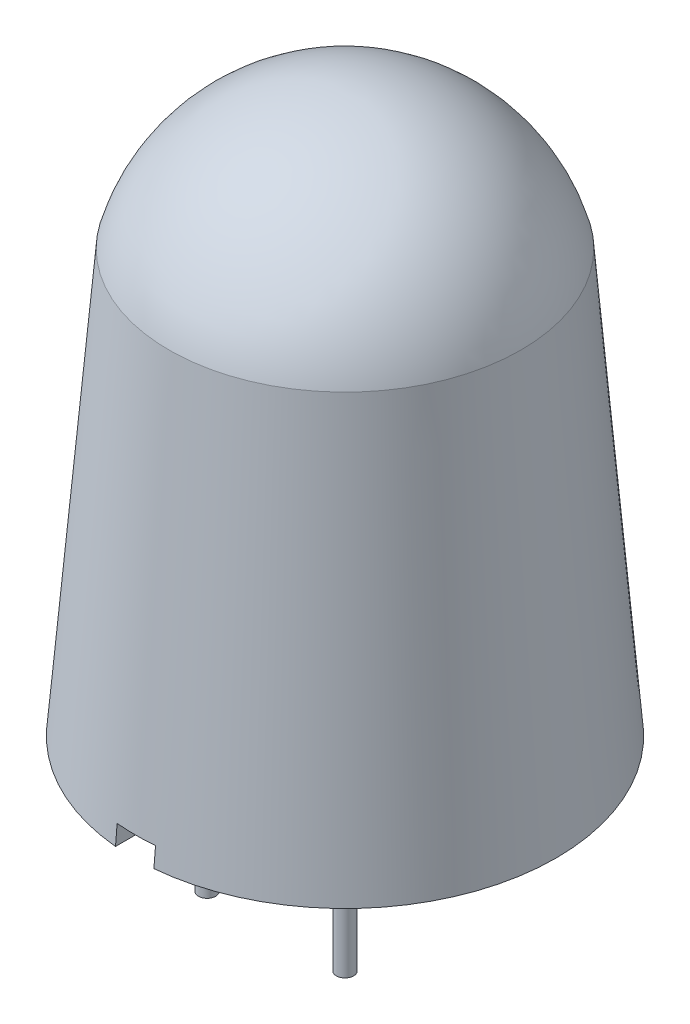
ISO-10303-21;
HEADER;
FILE_DESCRIPTION(('STEP AP214'),'2;1');
FILE_NAME('part.step','',(''),(''),'','','');
FILE_SCHEMA(('AUTOMOTIVE_DESIGN { 1 0 10303 214 1 1 1 1 }'));
ENDSEC;
DATA;
#1=APPLICATION_CONTEXT('core data for automotive mechanical design processes');
#2=APPLICATION_PROTOCOL_DEFINITION('international standard','automotive_design',2000,#1);
#3=PRODUCT_CONTEXT('',#1,'mechanical');
#4=PRODUCT('Part','Part','',(#3));
#5=PRODUCT_RELATED_PRODUCT_CATEGORY('part','',(#4));
#6=PRODUCT_DEFINITION_FORMATION('','',#4);
#7=PRODUCT_DEFINITION_CONTEXT('part definition',#1,'design');
#8=PRODUCT_DEFINITION('design','',#6,#7);
#9=PRODUCT_DEFINITION_SHAPE('','',#8);
#10=(LENGTH_UNIT() NAMED_UNIT(*) SI_UNIT(.MILLI.,.METRE.));
#11=(NAMED_UNIT(*) PLANE_ANGLE_UNIT() SI_UNIT($,.RADIAN.));
#12=(NAMED_UNIT(*) SI_UNIT($,.STERADIAN.) SOLID_ANGLE_UNIT());
#13=UNCERTAINTY_MEASURE_WITH_UNIT(LENGTH_MEASURE(1.E-05),#10,'distance_accuracy_value','');
#14=(GEOMETRIC_REPRESENTATION_CONTEXT(3) GLOBAL_UNCERTAINTY_ASSIGNED_CONTEXT((#13)) GLOBAL_UNIT_ASSIGNED_CONTEXT((#10,
#11,#12)) REPRESENTATION_CONTEXT('',''));
#15=CARTESIAN_POINT('',(0.,0.,0.));
#16=DIRECTION('',(0.,0.,1.));
#17=DIRECTION('',(1.,0.,0.));
#18=AXIS2_PLACEMENT_3D('',#15,#16,#17);
#19=CARTESIAN_POINT('',(0.,1.,0.));
#20=DIRECTION('',(0.,-1.,0.));
#21=DIRECTION('',(0.,0.,-1.));
#22=AXIS2_PLACEMENT_3D('',#19,#20,#21);
#23=PLANE('',#22);
#24=CARTESIAN_POINT('',(-1.79605122421383,1.,1.79605122421383));
#25=DIRECTION('',(0.,-1.,0.));
#26=DIRECTION('',(0.,0.,-1.));
#27=AXIS2_PLACEMENT_3D('',#24,#25,#26);
#28=CIRCLE('',#27,0.225);
#29=CARTESIAN_POINT('',(-1.79605122421383,1.,1.57105122421383));
#30=VERTEX_POINT('',#29);
#31=EDGE_CURVE('E218',#30,#30,#28,.T.);
#32=ORIENTED_EDGE('',*,*,#31,.F.);
#33=EDGE_LOOP('',(#32));
#34=FACE_BOUND('',#33,.T.);
#35=CARTESIAN_POINT('',(0.,1.,0.));
#36=DIRECTION('',(0.,-1.,0.));
#37=DIRECTION('',(0.,0.,-1.));
#38=AXIS2_PLACEMENT_3D('',#35,#36,#37);
#39=CIRCLE('',#38,5.);
#40=CARTESIAN_POINT('',(0.,1.,-5.));
#41=VERTEX_POINT('',#40);
#42=EDGE_CURVE('E169',#41,#41,#39,.T.);
#43=ORIENTED_EDGE('',*,*,#42,.T.);
#44=EDGE_LOOP('',(#43));
#45=FACE_BOUND('',#44,.T.);
#46=CARTESIAN_POINT('',(1.79605122421384,1.,1.79605122421382));
#47=DIRECTION('',(0.,-1.,0.));
#48=DIRECTION('',(0.,0.,-1.));
#49=AXIS2_PLACEMENT_3D('',#46,#47,#48);
#50=CIRCLE('',#49,0.225);
#51=CARTESIAN_POINT('',(1.79605122421384,1.,1.57105122421382));
#52=VERTEX_POINT('',#51);
#53=EDGE_CURVE('E212',#52,#52,#50,.T.);
#54=ORIENTED_EDGE('',*,*,#53,.F.);
#55=EDGE_LOOP('',(#54));
#56=FACE_BOUND('',#55,.T.);
#57=CARTESIAN_POINT('',(-1.79605122421383,1.,-1.79605122421383));
#58=DIRECTION('',(0.,-1.,0.));
#59=DIRECTION('',(0.,0.,-1.));
#60=AXIS2_PLACEMENT_3D('',#57,#58,#59);
#61=CIRCLE('',#60,0.225);
#62=CARTESIAN_POINT('',(-1.79605122421383,1.,-2.02105122421383));
#63=VERTEX_POINT('',#62);
#64=EDGE_CURVE('E224',#63,#63,#61,.T.);
#65=ORIENTED_EDGE('',*,*,#64,.F.);
#66=EDGE_LOOP('',(#65));
#67=FACE_BOUND('',#66,.T.);
#68=ADVANCED_FACE('F37',(#34,#45,#56,#67),#23,.T.);
#69=CARTESIAN_POINT('',(0.,0.,0.));
#70=DIRECTION('',(0.,-1.,0.));
#71=DIRECTION('',(0.,0.,-1.));
#72=AXIS2_PLACEMENT_3D('',#69,#70,#71);
#73=CONICAL_SURFACE('',#72,5.5,0.0832096327061914);
#74=CARTESIAN_POINT('',(0.,11.,0.));
#75=DIRECTION('',(0.,-1.,0.));
#76=DIRECTION('',(0.,0.,-1.));
#77=AXIS2_PLACEMENT_3D('',#74,#75,#76);
#78=CIRCLE('',#77,4.58257569495584);
#79=CARTESIAN_POINT('',(0.,11.,-4.58257569495584));
#80=VERTEX_POINT('',#79);
#81=EDGE_CURVE('E179',#80,#80,#78,.T.);
#82=ORIENTED_EDGE('',*,*,#81,.T.);
#83=EDGE_LOOP('',(#82));
#84=FACE_BOUND('',#83,.T.);
#85=CARTESIAN_POINT('',(0.,0.5,0.));
#86=DIRECTION('',(0.,-1.,0.));
#87=DIRECTION('',(1.,0.,0.));
#88=AXIS2_PLACEMENT_3D('',#85,#86,#87);
#89=CIRCLE('',#88,5.45829889522526);
#90=CARTESIAN_POINT('',(0.5,0.5,-5.43534974308161));
#91=VERTEX_POINT('',#90);
#92=CARTESIAN_POINT('',(-0.5,0.5,-5.43534974308161));
#93=VERTEX_POINT('',#92);
#94=EDGE_CURVE('E124',#91,#93,#89,.F.);
#95=ORIENTED_EDGE('',*,*,#94,.T.);
#96=CARTESIAN_POINT('',(-0.5,10.426058612618,-4.60336926887664));
#97=CARTESIAN_POINT('',(-0.5,7.58595297669956,-4.84162572773607));
#98=CARTESIAN_POINT('',(-0.5,4.74583095498223,-5.07968671489484));
#99=CARTESIAN_POINT('',(-0.5,1.39081472009744,-5.36073740639706));
#100=CARTESIAN_POINT('',(-0.5,0.87593202342233,-5.40386457635922));
#101=CARTESIAN_POINT('',(-0.5,-2.99397219509746,-5.72797927626828));
#102=CARTESIAN_POINT('',(-0.5,-6.34900883615305,-6.00878630840863));
#103=CARTESIAN_POINT('',(-0.5,-9.70405357955887,-6.28949640702513));
#104=B_SPLINE_CURVE_WITH_KNOTS('',3,(#96,#97,#98,#99,#100,#101,#102,#103),.UNSPECIFIED.,.F.,.F.,
(4,2,2,4),(0.,8.55024532182711,10.1003025133284,20.2006050143794),.UNSPECIFIED.);
#105=CARTESIAN_POINT('',(-0.5,0.,-5.47722557505166));
#106=VERTEX_POINT('',#105);
#107=EDGE_CURVE('E158',#93,#106,#104,.T.);
#108=ORIENTED_EDGE('',*,*,#107,.T.);
#109=CARTESIAN_POINT('',(0.,0.,0.));
#110=DIRECTION('',(0.,-1.,0.));
#111=DIRECTION('',(0.,0.,-1.));
#112=AXIS2_PLACEMENT_3D('',#109,#110,#111);
#113=CIRCLE('',#112,5.5);
#114=CARTESIAN_POINT('',(-0.5,0.,5.47722557505166));
#115=VERTEX_POINT('',#114);
#116=EDGE_CURVE('E172',#115,#106,#113,.T.);
#117=ORIENTED_EDGE('',*,*,#116,.F.);
#118=CARTESIAN_POINT('',(-0.5,-9.70405357955887,6.28949640702513));
#119=CARTESIAN_POINT('',(-0.5,-8.0265308802767,6.14914522943913));
#120=CARTESIAN_POINT('',(-0.5,-6.34901052087661,6.00876607758495));
#121=CARTESIAN_POINT('',(-0.5,-2.99397587699082,5.7279352610525));
#122=CARTESIAN_POINT('',(-0.5,-1.31646159250511,5.58748359637446));
#123=CARTESIAN_POINT('',(-0.5,2.03855951881204,5.30649118886826));
#124=CARTESIAN_POINT('',(-0.5,3.71606634564347,5.16595044604));
#125=CARTESIAN_POINT('',(-0.5,7.07107030803121,4.88475327406694));
#126=CARTESIAN_POINT('',(-0.5,8.74856744358748,4.74409684492179));
#127=CARTESIAN_POINT('',(-0.5,10.426058612618,4.60336926887664));
#128=B_SPLINE_CURVE_WITH_KNOTS('',3,(#118,#119,#120,#121,#122,#123,#124,#125,#126,#127),
.UNSPECIFIED.,.F.,.F.,(4,2,2,2,4),(0.,5.05015125941694,10.1003025034101,15.1504537539167,
20.2006050199563),.UNSPECIFIED.);
#129=CARTESIAN_POINT('',(-0.5,0.5,5.43534974308161));
#130=VERTEX_POINT('',#129);
#131=EDGE_CURVE('E123',#115,#130,#128,.T.);
#132=ORIENTED_EDGE('',*,*,#131,.T.);
#133=CARTESIAN_POINT('',(0.5,0.5,5.43534974308161));
#134=VERTEX_POINT('',#133);
#135=EDGE_CURVE('E115',#130,#134,#89,.F.);
#136=ORIENTED_EDGE('',*,*,#135,.T.);
#137=CARTESIAN_POINT('',(0.500000000000002,10.426058612618,4.60336926887664));
#138=CARTESIAN_POINT('',(0.500000000000002,7.58595297669956,4.84162572773607));
#139=CARTESIAN_POINT('',(0.500000000000001,4.74583095498223,5.07968671489484));
#140=CARTESIAN_POINT('',(0.5,1.39081472009744,5.36073740639706));
#141=CARTESIAN_POINT('',(0.5,0.875932023422331,5.40386457635922));
#142=CARTESIAN_POINT('',(0.499999999999999,-2.99397219509746,5.72797927626828));
#143=CARTESIAN_POINT('',(0.499999999999999,-6.34900883615305,6.00878630840863));
#144=CARTESIAN_POINT('',(0.499999999999998,-9.70405357955887,6.28949640702513));
#145=B_SPLINE_CURVE_WITH_KNOTS('',3,(#137,#138,#139,#140,#141,#142,#143,#144),.UNSPECIFIED.,.F.,
.F.,(4,2,2,4),(0.,8.55024532182711,10.1003025133284,20.2006050143794),.UNSPECIFIED.);
#146=CARTESIAN_POINT('',(0.5,0.,5.47722557505166));
#147=VERTEX_POINT('',#146);
#148=EDGE_CURVE('E101',#134,#147,#145,.T.);
#149=ORIENTED_EDGE('',*,*,#148,.T.);
#150=CARTESIAN_POINT('',(0.5,0.,-5.47722557505166));
#151=VERTEX_POINT('',#150);
#152=EDGE_CURVE('E178',#151,#147,#113,.T.);
#153=ORIENTED_EDGE('',*,*,#152,.F.);
#154=CARTESIAN_POINT('',(0.499999999999998,-9.70405357955887,-6.28949640702513));
#155=CARTESIAN_POINT('',(0.499999999999998,-8.0265308802767,-6.14914522943913));
#156=CARTESIAN_POINT('',(0.499999999999999,-6.34901052087661,-6.00876607758495));
#157=CARTESIAN_POINT('',(0.499999999999999,-2.99397587699082,-5.7279352610525));
#158=CARTESIAN_POINT('',(0.5,-1.31646159250511,-5.58748359637446));
#159=CARTESIAN_POINT('',(0.5,2.03855951881204,-5.30649118886826));
#160=CARTESIAN_POINT('',(0.500000000000001,3.71606634564347,-5.16595044604));
#161=CARTESIAN_POINT('',(0.500000000000002,7.07107030803121,-4.88475327406694));
#162=CARTESIAN_POINT('',(0.500000000000002,8.74856744358748,-4.74409684492179));
#163=CARTESIAN_POINT('',(0.500000000000002,10.426058612618,-4.60336926887664));
#164=B_SPLINE_CURVE_WITH_KNOTS('',3,(#154,#155,#156,#157,#158,#159,#160,#161,#162,#163),
.UNSPECIFIED.,.F.,.F.,(4,2,2,2,4),(0.,5.05015125941694,10.1003025034101,15.1504537539167,
20.2006050199563),.UNSPECIFIED.);
#165=EDGE_CURVE('E133',#151,#91,#164,.T.);
#166=ORIENTED_EDGE('',*,*,#165,.T.);
#167=EDGE_LOOP('',(#95,#108,#117,#132,#136,#149,#153,#166));
#168=FACE_BOUND('',#167,.T.);
#169=ADVANCED_FACE('F121',(#84,#168),#73,.T.);
#170=CARTESIAN_POINT('',(0.,0.,0.));
#171=DIRECTION('',(0.,-1.,0.));
#172=DIRECTION('',(0.,0.,-1.));
#173=AXIS2_PLACEMENT_3D('',#170,#171,#172);
#174=PLANE('',#173);
#175=ORIENTED_EDGE('',*,*,#116,.T.);
#176=DIRECTION('',(0.,0.,1.));
#177=VECTOR('',#176,1.);
#178=CARTESIAN_POINT('',(-0.5,0.,0.));
#179=LINE('',#178,#177);
#180=CARTESIAN_POINT('',(-0.5,0.,-4.9749371855331));
#181=VERTEX_POINT('',#180);
#182=EDGE_CURVE('E205',#106,#181,#179,.T.);
#183=ORIENTED_EDGE('',*,*,#182,.T.);
#184=CARTESIAN_POINT('',(0.,0.,0.));
#185=DIRECTION('',(0.,-1.,0.));
#186=DIRECTION('',(0.,0.,-1.));
#187=AXIS2_PLACEMENT_3D('',#184,#185,#186);
#188=CIRCLE('',#187,5.);
#189=CARTESIAN_POINT('',(-0.5,0.,4.9749371855331));
#190=VERTEX_POINT('',#189);
#191=EDGE_CURVE('E167',#190,#181,#188,.T.);
#192=ORIENTED_EDGE('',*,*,#191,.F.);
#193=EDGE_CURVE('E168',#190,#115,#179,.T.);
#194=ORIENTED_EDGE('',*,*,#193,.T.);
#195=EDGE_LOOP('',(#175,#183,#192,#194));
#196=FACE_BOUND('',#195,.T.);
#197=ADVANCED_FACE('F204',(#196),#174,.T.);
#198=ORIENTED_EDGE('',*,*,#152,.T.);
#199=DIRECTION('',(0.,0.,-1.));
#200=VECTOR('',#199,1.);
#201=CARTESIAN_POINT('',(0.5,0.,0.));
#202=LINE('',#201,#200);
#203=CARTESIAN_POINT('',(0.5,0.,4.9749371855331));
#204=VERTEX_POINT('',#203);
#205=EDGE_CURVE('E107',#147,#204,#202,.T.);
#206=ORIENTED_EDGE('',*,*,#205,.T.);
#207=CARTESIAN_POINT('',(0.5,0.,-4.9749371855331));
#208=VERTEX_POINT('',#207);
#209=EDGE_CURVE('E173',#208,#204,#188,.T.);
#210=ORIENTED_EDGE('',*,*,#209,.F.);
#211=EDGE_CURVE('E112',#208,#151,#202,.T.);
#212=ORIENTED_EDGE('',*,*,#211,.T.);
#213=EDGE_LOOP('',(#198,#206,#210,#212));
#214=FACE_BOUND('',#213,.T.);
#215=ADVANCED_FACE('F210',(#214),#174,.T.);
#216=CARTESIAN_POINT('',(0.,1.,0.));
#217=DIRECTION('',(0.,-1.,0.));
#218=DIRECTION('',(0.,0.,-1.));
#219=AXIS2_PLACEMENT_3D('',#216,#217,#218);
#220=CYLINDRICAL_SURFACE('',#219,5.);
#221=ORIENTED_EDGE('',*,*,#42,.F.);
#222=EDGE_LOOP('',(#221));
#223=FACE_BOUND('',#222,.T.);
#224=DIRECTION('',(0.,-1.,0.));
#225=VECTOR('',#224,1.);
#226=CARTESIAN_POINT('',(-0.5,1.,-4.9749371855331));
#227=LINE('',#226,#225);
#228=CARTESIAN_POINT('',(-0.5,0.5,-4.9749371855331));
#229=VERTEX_POINT('',#228);
#230=EDGE_CURVE('E11',#229,#181,#227,.T.);
#231=ORIENTED_EDGE('',*,*,#230,.F.);
#232=CARTESIAN_POINT('',(0.,0.5,0.));
#233=DIRECTION('',(0.,-1.,0.));
#234=DIRECTION('',(1.,0.,0.));
#235=AXIS2_PLACEMENT_3D('',#232,#233,#234);
#236=CIRCLE('',#235,5.);
#237=CARTESIAN_POINT('',(0.5,0.5,-4.9749371855331));
#238=VERTEX_POINT('',#237);
#239=EDGE_CURVE('E184',#238,#229,#236,.F.);
#240=ORIENTED_EDGE('',*,*,#239,.F.);
#241=DIRECTION('',(0.,-1.,0.));
#242=VECTOR('',#241,1.);
#243=CARTESIAN_POINT('',(0.5,1.,-4.9749371855331));
#244=LINE('',#243,#242);
#245=EDGE_CURVE('E45',#208,#238,#244,.F.);
#246=ORIENTED_EDGE('',*,*,#245,.F.);
#247=ORIENTED_EDGE('',*,*,#209,.T.);
#248=DIRECTION('',(0.,-1.,0.));
#249=VECTOR('',#248,1.);
#250=CARTESIAN_POINT('',(0.5,1.,4.9749371855331));
#251=LINE('',#250,#249);
#252=CARTESIAN_POINT('',(0.5,0.5,4.9749371855331));
#253=VERTEX_POINT('',#252);
#254=EDGE_CURVE('E183',#253,#204,#251,.T.);
#255=ORIENTED_EDGE('',*,*,#254,.F.);
#256=CARTESIAN_POINT('',(-0.5,0.5,4.9749371855331));
#257=VERTEX_POINT('',#256);
#258=EDGE_CURVE('E117',#257,#253,#236,.F.);
#259=ORIENTED_EDGE('',*,*,#258,.F.);
#260=DIRECTION('',(0.,-1.,0.));
#261=VECTOR('',#260,1.);
#262=CARTESIAN_POINT('',(-0.5,1.,4.9749371855331));
#263=LINE('',#262,#261);
#264=EDGE_CURVE('E186',#190,#257,#263,.F.);
#265=ORIENTED_EDGE('',*,*,#264,.F.);
#266=ORIENTED_EDGE('',*,*,#191,.T.);
#267=EDGE_LOOP('',(#231,#240,#246,#247,#255,#259,#265,#266));
#268=FACE_BOUND('',#267,.T.);
#269=ADVANCED_FACE('F199',(#223,#268),#220,.F.);
#270=CARTESIAN_POINT('',(0.,9.75,0.));
#271=DIRECTION('',(0.,-1.,0.));
#272=DIRECTION('',(1.,0.,0.));
#273=AXIS2_PLACEMENT_3D('',#270,#271,#272);
#274=SPHERICAL_SURFACE('',#273,4.75);
#275=ORIENTED_EDGE('',*,*,#81,.F.);
#276=EDGE_LOOP('',(#275));
#277=FACE_BOUND('',#276,.T.);
#278=ADVANCED_FACE('F39',(#277),#274,.T.);
#279=CARTESIAN_POINT('',(-0.5,0.5,12.));
#280=DIRECTION('',(0.,-1.,0.));
#281=DIRECTION('',(1.,0.,0.));
#282=AXIS2_PLACEMENT_3D('',#279,#280,#281);
#283=PLANE('',#282);
#284=DIRECTION('',(0.,0.,-1.));
#285=VECTOR('',#284,1.);
#286=CARTESIAN_POINT('',(-0.5,0.5,12.));
#287=LINE('',#286,#285);
#288=EDGE_CURVE('E60',#130,#257,#287,.T.);
#289=ORIENTED_EDGE('',*,*,#288,.T.);
#290=ORIENTED_EDGE('',*,*,#258,.T.);
#291=DIRECTION('',(0.,0.,-1.));
#292=VECTOR('',#291,1.);
#293=CARTESIAN_POINT('',(0.5,0.5,12.));
#294=LINE('',#293,#292);
#295=EDGE_CURVE('E104',#134,#253,#294,.T.);
#296=ORIENTED_EDGE('',*,*,#295,.F.);
#297=ORIENTED_EDGE('',*,*,#135,.F.);
#298=EDGE_LOOP('',(#289,#290,#296,#297));
#299=FACE_BOUND('',#298,.T.);
#300=ADVANCED_FACE('F114',(#299),#283,.T.);
#301=CARTESIAN_POINT('',(0.5,-0.5,12.));
#302=DIRECTION('',(-1.,0.,0.));
#303=DIRECTION('',(0.,-1.,0.));
#304=AXIS2_PLACEMENT_3D('',#301,#302,#303);
#305=PLANE('',#304);
#306=ORIENTED_EDGE('',*,*,#295,.T.);
#307=ORIENTED_EDGE('',*,*,#254,.T.);
#308=ORIENTED_EDGE('',*,*,#205,.F.);
#309=ORIENTED_EDGE('',*,*,#148,.F.);
#310=EDGE_LOOP('',(#306,#307,#308,#309));
#311=FACE_BOUND('',#310,.T.);
#312=ADVANCED_FACE('F103',(#311),#305,.T.);
#313=CARTESIAN_POINT('',(-0.5,-0.5,12.));
#314=DIRECTION('',(1.,0.,0.));
#315=DIRECTION('',(0.,0.,-1.));
#316=AXIS2_PLACEMENT_3D('',#313,#314,#315);
#317=PLANE('',#316);
#318=ORIENTED_EDGE('',*,*,#193,.F.);
#319=ORIENTED_EDGE('',*,*,#264,.T.);
#320=ORIENTED_EDGE('',*,*,#288,.F.);
#321=ORIENTED_EDGE('',*,*,#131,.F.);
#322=EDGE_LOOP('',(#318,#319,#320,#321));
#323=FACE_BOUND('',#322,.T.);
#324=ADVANCED_FACE('F144',(#323),#317,.T.);
#325=ORIENTED_EDGE('',*,*,#211,.F.);
#326=ORIENTED_EDGE('',*,*,#245,.T.);
#327=EDGE_CURVE('E52',#238,#91,#294,.T.);
#328=ORIENTED_EDGE('',*,*,#327,.T.);
#329=ORIENTED_EDGE('',*,*,#165,.F.);
#330=EDGE_LOOP('',(#325,#326,#328,#329));
#331=FACE_BOUND('',#330,.T.);
#332=ADVANCED_FACE('F145',(#331),#305,.T.);
#333=ORIENTED_EDGE('',*,*,#327,.F.);
#334=ORIENTED_EDGE('',*,*,#239,.T.);
#335=EDGE_CURVE('E192',#229,#93,#287,.T.);
#336=ORIENTED_EDGE('',*,*,#335,.T.);
#337=ORIENTED_EDGE('',*,*,#94,.F.);
#338=EDGE_LOOP('',(#333,#334,#336,#337));
#339=FACE_BOUND('',#338,.T.);
#340=ADVANCED_FACE('F146',(#339),#283,.T.);
#341=ORIENTED_EDGE('',*,*,#335,.F.);
#342=ORIENTED_EDGE('',*,*,#230,.T.);
#343=ORIENTED_EDGE('',*,*,#182,.F.);
#344=ORIENTED_EDGE('',*,*,#107,.F.);
#345=EDGE_LOOP('',(#341,#342,#343,#344));
#346=FACE_BOUND('',#345,.T.);
#347=ADVANCED_FACE('F148',(#346),#317,.T.);
#348=CARTESIAN_POINT('',(1.79605122421384,-3.5,1.79605122421382));
#349=DIRECTION('',(0.,1.,0.));
#350=DIRECTION('',(0.,0.,1.));
#351=AXIS2_PLACEMENT_3D('',#348,#349,#350);
#352=CYLINDRICAL_SURFACE('',#351,0.225);
#353=CARTESIAN_POINT('',(1.79605122421384,-3.5,1.79605122421382));
#354=DIRECTION('',(0.,-1.,0.));
#355=DIRECTION('',(0.,0.,-1.));
#356=AXIS2_PLACEMENT_3D('',#353,#354,#355);
#357=CIRCLE('',#356,0.225);
#358=CARTESIAN_POINT('',(1.79605122421384,-3.5,1.57105122421382));
#359=VERTEX_POINT('',#358);
#360=EDGE_CURVE('E197',#359,#359,#357,.T.);
#361=ORIENTED_EDGE('',*,*,#360,.F.);
#362=EDGE_LOOP('',(#361));
#363=FACE_BOUND('',#362,.T.);
#364=ORIENTED_EDGE('',*,*,#53,.T.);
#365=EDGE_LOOP('',(#364));
#366=FACE_BOUND('',#365,.T.);
#367=ADVANCED_FACE('F153',(#363,#366),#352,.T.);
#368=CARTESIAN_POINT('',(1.79605122421384,-3.5,1.79605122421382));
#369=DIRECTION('',(0.,-1.,0.));
#370=DIRECTION('',(0.,0.,-1.));
#371=AXIS2_PLACEMENT_3D('',#368,#369,#370);
#372=PLANE('',#371);
#373=ORIENTED_EDGE('',*,*,#360,.T.);
#374=EDGE_LOOP('',(#373));
#375=FACE_BOUND('',#374,.T.);
#376=ADVANCED_FACE('F252',(#375),#372,.T.);
#377=CARTESIAN_POINT('',(-1.79605122421383,-3.5,1.79605122421383));
#378=DIRECTION('',(0.,1.,0.));
#379=DIRECTION('',(0.,0.,1.));
#380=AXIS2_PLACEMENT_3D('',#377,#378,#379);
#381=CYLINDRICAL_SURFACE('',#380,0.225);
#382=CARTESIAN_POINT('',(-1.79605122421383,-3.5,1.79605122421383));
#383=DIRECTION('',(0.,-1.,0.));
#384=DIRECTION('',(0.,0.,-1.));
#385=AXIS2_PLACEMENT_3D('',#382,#383,#384);
#386=CIRCLE('',#385,0.225);
#387=CARTESIAN_POINT('',(-1.79605122421383,-3.5,1.57105122421383));
#388=VERTEX_POINT('',#387);
#389=EDGE_CURVE('E215',#388,#388,#386,.T.);
#390=ORIENTED_EDGE('',*,*,#389,.F.);
#391=EDGE_LOOP('',(#390));
#392=FACE_BOUND('',#391,.T.);
#393=ORIENTED_EDGE('',*,*,#31,.T.);
#394=EDGE_LOOP('',(#393));
#395=FACE_BOUND('',#394,.T.);
#396=ADVANCED_FACE('F257',(#392,#395),#381,.T.);
#397=CARTESIAN_POINT('',(-1.79605122421383,-3.5,1.79605122421383));
#398=DIRECTION('',(0.,-1.,0.));
#399=DIRECTION('',(0.,0.,-1.));
#400=AXIS2_PLACEMENT_3D('',#397,#398,#399);
#401=PLANE('',#400);
#402=ORIENTED_EDGE('',*,*,#389,.T.);
#403=EDGE_LOOP('',(#402));
#404=FACE_BOUND('',#403,.T.);
#405=ADVANCED_FACE('F235',(#404),#401,.T.);
#406=CARTESIAN_POINT('',(-1.79605122421383,-3.5,-1.79605122421383));
#407=DIRECTION('',(0.,1.,0.));
#408=DIRECTION('',(0.,0.,1.));
#409=AXIS2_PLACEMENT_3D('',#406,#407,#408);
#410=CYLINDRICAL_SURFACE('',#409,0.225);
#411=CARTESIAN_POINT('',(-1.79605122421383,-3.5,-1.79605122421383));
#412=DIRECTION('',(0.,-1.,0.));
#413=DIRECTION('',(0.,0.,-1.));
#414=AXIS2_PLACEMENT_3D('',#411,#412,#413);
#415=CIRCLE('',#414,0.225);
#416=CARTESIAN_POINT('',(-1.79605122421383,-3.5,-2.02105122421383));
#417=VERTEX_POINT('',#416);
#418=EDGE_CURVE('E221',#417,#417,#415,.T.);
#419=ORIENTED_EDGE('',*,*,#418,.F.);
#420=EDGE_LOOP('',(#419));
#421=FACE_BOUND('',#420,.T.);
#422=ORIENTED_EDGE('',*,*,#64,.T.);
#423=EDGE_LOOP('',(#422));
#424=FACE_BOUND('',#423,.T.);
#425=ADVANCED_FACE('F232',(#421,#424),#410,.T.);
#426=CARTESIAN_POINT('',(-1.79605122421383,-3.5,-1.79605122421383));
#427=DIRECTION('',(0.,-1.,0.));
#428=DIRECTION('',(0.,0.,-1.));
#429=AXIS2_PLACEMENT_3D('',#426,#427,#428);
#430=PLANE('',#429);
#431=ORIENTED_EDGE('',*,*,#418,.T.);
#432=EDGE_LOOP('',(#431));
#433=FACE_BOUND('',#432,.T.);
#434=ADVANCED_FACE('F230',(#433),#430,.T.);
#435=CLOSED_SHELL('',(#68,#169,#197,#215,#269,#278,#300,#312,#324,#332,#340,#347,#367,#376,#396,
#405,#425,#434));
#436=MANIFOLD_SOLID_BREP('B2',#435);
#437=ADVANCED_BREP_SHAPE_REPRESENTATION('',(#18,#436),#14);
#438=SHAPE_DEFINITION_REPRESENTATION(#9,#437);
ENDSEC;
END-ISO-10303-21;
